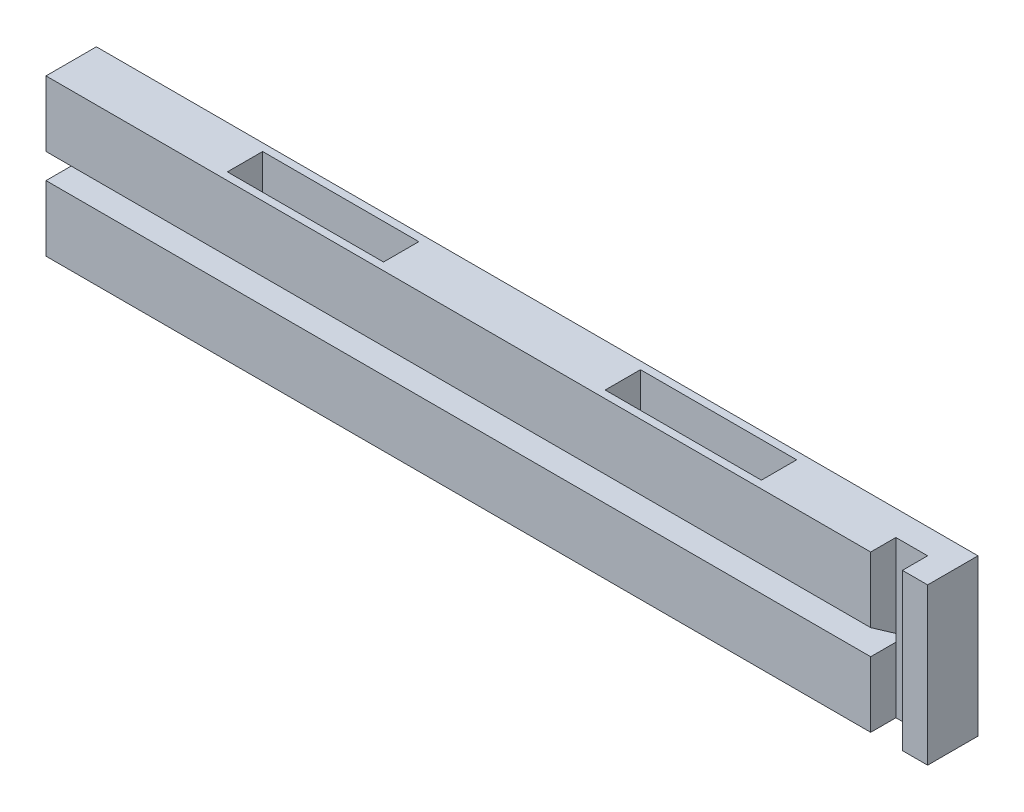
ISO-10303-21;
HEADER;
FILE_DESCRIPTION(('STEP AP214'),'2;1');
FILE_NAME('part.step','',(''),(''),'','','');
FILE_SCHEMA(('AUTOMOTIVE_DESIGN { 1 0 10303 214 1 1 1 1 }'));
ENDSEC;
DATA;
#1=APPLICATION_CONTEXT('core data for automotive mechanical design processes');
#2=APPLICATION_PROTOCOL_DEFINITION('international standard','automotive_design',2000,#1);
#3=PRODUCT_CONTEXT('',#1,'mechanical');
#4=PRODUCT('Part','Part','',(#3));
#5=PRODUCT_RELATED_PRODUCT_CATEGORY('part','',(#4));
#6=PRODUCT_DEFINITION_FORMATION('','',#4);
#7=PRODUCT_DEFINITION_CONTEXT('part definition',#1,'design');
#8=PRODUCT_DEFINITION('design','',#6,#7);
#9=PRODUCT_DEFINITION_SHAPE('','',#8);
#10=(LENGTH_UNIT() NAMED_UNIT(*) SI_UNIT(.MILLI.,.METRE.));
#11=(NAMED_UNIT(*) PLANE_ANGLE_UNIT() SI_UNIT($,.RADIAN.));
#12=(NAMED_UNIT(*) SI_UNIT($,.STERADIAN.) SOLID_ANGLE_UNIT());
#13=UNCERTAINTY_MEASURE_WITH_UNIT(LENGTH_MEASURE(1.E-05),#10,'distance_accuracy_value','');
#14=(GEOMETRIC_REPRESENTATION_CONTEXT(3) GLOBAL_UNCERTAINTY_ASSIGNED_CONTEXT((#13)) GLOBAL_UNIT_ASSIGNED_CONTEXT((#10,
#11,#12)) REPRESENTATION_CONTEXT('',''));
#15=CARTESIAN_POINT('',(0.,0.,0.));
#16=DIRECTION('',(0.,0.,1.));
#17=DIRECTION('',(1.,0.,0.));
#18=AXIS2_PLACEMENT_3D('',#15,#16,#17);
#19=CARTESIAN_POINT('',(0.,0.,10.));
#20=DIRECTION('',(0.,0.,1.));
#21=DIRECTION('',(1.,0.,0.));
#22=AXIS2_PLACEMENT_3D('',#19,#20,#21);
#23=PLANE('',#22);
#24=DIRECTION('',(-1.,0.,0.));
#25=VECTOR('',#24,1.);
#26=CARTESIAN_POINT('',(84.9172339781055,-2.5,10.));
#27=LINE('',#26,#25);
#28=CARTESIAN_POINT('',(76.2,-2.5,10.));
#29=VERTEX_POINT('',#28);
#30=CARTESIAN_POINT('',(-87.5,-2.5,10.));
#31=VERTEX_POINT('',#30);
#32=EDGE_CURVE('E300',#29,#31,#27,.T.);
#33=ORIENTED_EDGE('',*,*,#32,.T.);
#34=DIRECTION('',(0.,-1.,0.));
#35=VECTOR('',#34,1.);
#36=CARTESIAN_POINT('',(-87.5,-15.5,10.));
#37=LINE('',#36,#35);
#38=CARTESIAN_POINT('',(-87.5,-15.5,10.));
#39=VERTEX_POINT('',#38);
#40=EDGE_CURVE('E244',#31,#39,#37,.T.);
#41=ORIENTED_EDGE('',*,*,#40,.T.);
#42=DIRECTION('',(1.,0.,0.));
#43=VECTOR('',#42,1.);
#44=CARTESIAN_POINT('',(87.5,-15.5,10.));
#45=LINE('',#44,#43);
#46=CARTESIAN_POINT('',(76.2,-15.5,10.));
#47=VERTEX_POINT('',#46);
#48=EDGE_CURVE('E246',#39,#47,#45,.T.);
#49=ORIENTED_EDGE('',*,*,#48,.T.);
#50=DIRECTION('',(0.,-1.,0.));
#51=VECTOR('',#50,1.);
#52=CARTESIAN_POINT('',(76.2,-15.5,10.));
#53=LINE('',#52,#51);
#54=EDGE_CURVE('E299',#29,#47,#53,.T.);
#55=ORIENTED_EDGE('',*,*,#54,.F.);
#56=EDGE_LOOP('',(#33,#41,#49,#55));
#57=FACE_BOUND('',#56,.T.);
#58=ADVANCED_FACE('F32',(#57),#23,.T.);
#59=CARTESIAN_POINT('',(76.2,-15.5,5.));
#60=DIRECTION('',(-1.,0.,0.));
#61=DIRECTION('',(0.,0.,1.));
#62=AXIS2_PLACEMENT_3D('',#59,#60,#61);
#63=PLANE('',#62);
#64=DIRECTION('',(0.,-1.,0.));
#65=VECTOR('',#64,1.);
#66=CARTESIAN_POINT('',(76.2,-15.5,5.));
#67=LINE('',#66,#65);
#68=CARTESIAN_POINT('',(76.2,-2.5,5.));
#69=VERTEX_POINT('',#68);
#70=CARTESIAN_POINT('',(76.2,-15.5,5.));
#71=VERTEX_POINT('',#70);
#72=EDGE_CURVE('E314',#69,#71,#67,.T.);
#73=ORIENTED_EDGE('',*,*,#72,.F.);
#74=DIRECTION('',(0.,0.,-1.));
#75=VECTOR('',#74,1.);
#76=CARTESIAN_POINT('',(76.2,-2.5,2.85925996628941));
#77=LINE('',#76,#75);
#78=EDGE_CURVE('E47',#29,#69,#77,.T.);
#79=ORIENTED_EDGE('',*,*,#78,.F.);
#80=ORIENTED_EDGE('',*,*,#54,.T.);
#81=DIRECTION('',(0.,0.,1.));
#82=VECTOR('',#81,1.);
#83=CARTESIAN_POINT('',(76.2,-15.5,5.));
#84=LINE('',#83,#82);
#85=EDGE_CURVE('E295',#71,#47,#84,.T.);
#86=ORIENTED_EDGE('',*,*,#85,.F.);
#87=EDGE_LOOP('',(#73,#79,#80,#86));
#88=FACE_BOUND('',#87,.T.);
#89=ADVANCED_FACE('F500',(#88),#63,.F.);
#90=DIRECTION('',(-1.,0.,0.));
#91=VECTOR('',#90,1.);
#92=CARTESIAN_POINT('',(84.9172339781055,2.5,10.));
#93=LINE('',#92,#91);
#94=CARTESIAN_POINT('',(76.2,2.5,10.));
#95=VERTEX_POINT('',#94);
#96=CARTESIAN_POINT('',(-87.5,2.5,10.));
#97=VERTEX_POINT('',#96);
#98=EDGE_CURVE('E217',#95,#97,#93,.T.);
#99=ORIENTED_EDGE('',*,*,#98,.F.);
#100=CARTESIAN_POINT('',(76.2,15.5,10.));
#101=VERTEX_POINT('',#100);
#102=EDGE_CURVE('E323',#101,#95,#53,.T.);
#103=ORIENTED_EDGE('',*,*,#102,.F.);
#104=DIRECTION('',(-1.,0.,0.));
#105=VECTOR('',#104,1.);
#106=CARTESIAN_POINT('',(87.5,15.5,10.));
#107=LINE('',#106,#105);
#108=CARTESIAN_POINT('',(-87.5,15.5,10.));
#109=VERTEX_POINT('',#108);
#110=EDGE_CURVE('E241',#101,#109,#107,.T.);
#111=ORIENTED_EDGE('',*,*,#110,.T.);
#112=EDGE_CURVE('E237',#109,#97,#37,.T.);
#113=ORIENTED_EDGE('',*,*,#112,.T.);
#114=EDGE_LOOP('',(#99,#103,#111,#113));
#115=FACE_BOUND('',#114,.T.);
#116=ADVANCED_FACE('F239',(#115),#23,.T.);
#117=CARTESIAN_POINT('',(-87.5,-15.5,10.));
#118=DIRECTION('',(1.,0.,0.));
#119=DIRECTION('',(0.,0.,-1.));
#120=AXIS2_PLACEMENT_3D('',#117,#118,#119);
#121=PLANE('',#120);
#122=CARTESIAN_POINT('',(-87.5,10.5,5.));
#123=DIRECTION('',(-1.,0.,0.));
#124=DIRECTION('',(0.,0.,1.));
#125=AXIS2_PLACEMENT_3D('',#122,#123,#124);
#126=CIRCLE('',#125,1.5);
#127=CARTESIAN_POINT('',(-87.5,10.5,6.5));
#128=VERTEX_POINT('',#127);
#129=EDGE_CURVE('E339',#128,#128,#126,.T.);
#130=ORIENTED_EDGE('',*,*,#129,.F.);
#131=EDGE_LOOP('',(#130));
#132=FACE_BOUND('',#131,.T.);
#133=CARTESIAN_POINT('',(-87.5,-10.5,5.));
#134=DIRECTION('',(-1.,0.,0.));
#135=DIRECTION('',(0.,0.,-1.));
#136=AXIS2_PLACEMENT_3D('',#133,#134,#135);
#137=CIRCLE('',#136,1.5);
#138=CARTESIAN_POINT('',(-87.5,-10.5,3.5));
#139=VERTEX_POINT('',#138);
#140=EDGE_CURVE('E329',#139,#139,#137,.T.);
#141=ORIENTED_EDGE('',*,*,#140,.F.);
#142=EDGE_LOOP('',(#141));
#143=FACE_BOUND('',#142,.T.);
#144=ORIENTED_EDGE('',*,*,#40,.F.);
#145=DIRECTION('',(0.,0.,1.));
#146=VECTOR('',#145,1.);
#147=CARTESIAN_POINT('',(-87.5,-2.5,2.85925996628941));
#148=LINE('',#147,#146);
#149=CARTESIAN_POINT('',(-87.5,-2.5,2.85925996628941));
#150=VERTEX_POINT('',#149);
#151=EDGE_CURVE('E231',#150,#31,#148,.T.);
#152=ORIENTED_EDGE('',*,*,#151,.F.);
#153=DIRECTION('',(0.,-0.573576436351045,-0.819152044288992));
#154=VECTOR('',#153,1.);
#155=CARTESIAN_POINT('',(-87.5,2.5,10.));
#156=LINE('',#155,#154);
#157=EDGE_CURVE('E222',#97,#150,#156,.T.);
#158=ORIENTED_EDGE('',*,*,#157,.F.);
#159=ORIENTED_EDGE('',*,*,#112,.F.);
#160=DIRECTION('',(0.,0.,-1.));
#161=VECTOR('',#160,1.);
#162=CARTESIAN_POINT('',(-87.5,15.5,10.));
#163=LINE('',#162,#161);
#164=CARTESIAN_POINT('',(-87.5,15.5,0.));
#165=VERTEX_POINT('',#164);
#166=EDGE_CURVE('E259',#109,#165,#163,.T.);
#167=ORIENTED_EDGE('',*,*,#166,.T.);
#168=DIRECTION('',(0.,-1.,0.));
#169=VECTOR('',#168,1.);
#170=CARTESIAN_POINT('',(-87.5,-15.5,0.));
#171=LINE('',#170,#169);
#172=CARTESIAN_POINT('',(-87.5,-15.5,0.));
#173=VERTEX_POINT('',#172);
#174=EDGE_CURVE('E260',#165,#173,#171,.T.);
#175=ORIENTED_EDGE('',*,*,#174,.T.);
#176=DIRECTION('',(0.,0.,-1.));
#177=VECTOR('',#176,1.);
#178=CARTESIAN_POINT('',(-87.5,-15.5,10.));
#179=LINE('',#178,#177);
#180=EDGE_CURVE('E11',#39,#173,#179,.T.);
#181=ORIENTED_EDGE('',*,*,#180,.F.);
#182=EDGE_LOOP('',(#144,#152,#158,#159,#167,#175,#181));
#183=FACE_BOUND('',#182,.T.);
#184=ADVANCED_FACE('F34',(#132,#143,#183),#121,.F.);
#185=CARTESIAN_POINT('',(87.5,-15.5,10.));
#186=DIRECTION('',(0.,1.,0.));
#187=DIRECTION('',(-1.,0.,0.));
#188=AXIS2_PLACEMENT_3D('',#185,#186,#187);
#189=PLANE('',#188);
#190=DIRECTION('',(1.,0.,0.));
#191=VECTOR('',#190,1.);
#192=CARTESIAN_POINT('',(-22.,-15.5,1.5));
#193=LINE('',#192,#191);
#194=CARTESIAN_POINT('',(-53.,-15.5,1.5));
#195=VERTEX_POINT('',#194);
#196=CARTESIAN_POINT('',(-22.,-15.5,1.5));
#197=VERTEX_POINT('',#196);
#198=EDGE_CURVE('E363',#195,#197,#193,.T.);
#199=ORIENTED_EDGE('',*,*,#198,.F.);
#200=DIRECTION('',(0.,0.,-1.));
#201=VECTOR('',#200,1.);
#202=CARTESIAN_POINT('',(-53.,-15.5,1.5));
#203=LINE('',#202,#201);
#204=CARTESIAN_POINT('',(-53.,-15.5,8.5));
#205=VERTEX_POINT('',#204);
#206=EDGE_CURVE('E361',#205,#195,#203,.T.);
#207=ORIENTED_EDGE('',*,*,#206,.F.);
#208=DIRECTION('',(-1.,0.,0.));
#209=VECTOR('',#208,1.);
#210=CARTESIAN_POINT('',(-22.,-15.5,8.5));
#211=LINE('',#210,#209);
#212=CARTESIAN_POINT('',(-22.,-15.5,8.5));
#213=VERTEX_POINT('',#212);
#214=EDGE_CURVE('E351',#213,#205,#211,.T.);
#215=ORIENTED_EDGE('',*,*,#214,.F.);
#216=DIRECTION('',(0.,0.,1.));
#217=VECTOR('',#216,1.);
#218=CARTESIAN_POINT('',(-22.,-15.5,1.5));
#219=LINE('',#218,#217);
#220=EDGE_CURVE('E367',#197,#213,#219,.T.);
#221=ORIENTED_EDGE('',*,*,#220,.F.);
#222=EDGE_LOOP('',(#199,#207,#215,#221));
#223=FACE_BOUND('',#222,.T.);
#224=DIRECTION('',(1.,0.,0.));
#225=VECTOR('',#224,1.);
#226=CARTESIAN_POINT('',(22.,-15.5,1.50000000000001));
#227=LINE('',#226,#225);
#228=CARTESIAN_POINT('',(22.,-15.5,1.50000000000001));
#229=VERTEX_POINT('',#228);
#230=CARTESIAN_POINT('',(53.,-15.5,1.50000000000001));
#231=VERTEX_POINT('',#230);
#232=EDGE_CURVE('E396',#229,#231,#227,.T.);
#233=ORIENTED_EDGE('',*,*,#232,.F.);
#234=DIRECTION('',(0.,0.,-1.));
#235=VECTOR('',#234,1.);
#236=CARTESIAN_POINT('',(22.,-15.5,1.50000000000001));
#237=LINE('',#236,#235);
#238=CARTESIAN_POINT('',(22.,-15.5,8.50000000000001));
#239=VERTEX_POINT('',#238);
#240=EDGE_CURVE('E338',#239,#229,#237,.T.);
#241=ORIENTED_EDGE('',*,*,#240,.F.);
#242=DIRECTION('',(-1.,0.,0.));
#243=VECTOR('',#242,1.);
#244=CARTESIAN_POINT('',(22.,-15.5,8.50000000000001));
#245=LINE('',#244,#243);
#246=CARTESIAN_POINT('',(53.,-15.5,8.50000000000001));
#247=VERTEX_POINT('',#246);
#248=EDGE_CURVE('E385',#247,#239,#245,.T.);
#249=ORIENTED_EDGE('',*,*,#248,.F.);
#250=DIRECTION('',(0.,0.,1.));
#251=VECTOR('',#250,1.);
#252=CARTESIAN_POINT('',(53.,-15.5,1.50000000000001));
#253=LINE('',#252,#251);
#254=EDGE_CURVE('E399',#231,#247,#253,.T.);
#255=ORIENTED_EDGE('',*,*,#254,.F.);
#256=EDGE_LOOP('',(#233,#241,#249,#255));
#257=FACE_BOUND('',#256,.T.);
#258=DIRECTION('',(1.,0.,0.));
#259=VECTOR('',#258,1.);
#260=CARTESIAN_POINT('',(82.5,-15.5,5.));
#261=LINE('',#260,#259);
#262=CARTESIAN_POINT('',(82.5,-15.5,5.));
#263=VERTEX_POINT('',#262);
#264=EDGE_CURVE('E312',#71,#263,#261,.T.);
#265=ORIENTED_EDGE('',*,*,#264,.F.);
#266=ORIENTED_EDGE('',*,*,#85,.T.);
#267=ORIENTED_EDGE('',*,*,#48,.F.);
#268=ORIENTED_EDGE('',*,*,#180,.T.);
#269=DIRECTION('',(1.,0.,0.));
#270=VECTOR('',#269,1.);
#271=CARTESIAN_POINT('',(87.5,-15.5,0.));
#272=LINE('',#271,#270);
#273=CARTESIAN_POINT('',(87.5,-15.5,0.));
#274=VERTEX_POINT('',#273);
#275=EDGE_CURVE('E263',#173,#274,#272,.T.);
#276=ORIENTED_EDGE('',*,*,#275,.T.);
#277=DIRECTION('',(0.,0.,-1.));
#278=VECTOR('',#277,1.);
#279=CARTESIAN_POINT('',(87.5,-15.5,10.));
#280=LINE('',#279,#278);
#281=CARTESIAN_POINT('',(87.5,-15.5,10.));
#282=VERTEX_POINT('',#281);
#283=EDGE_CURVE('E40',#282,#274,#280,.T.);
#284=ORIENTED_EDGE('',*,*,#283,.F.);
#285=CARTESIAN_POINT('',(82.5,-15.5,10.));
#286=VERTEX_POINT('',#285);
#287=EDGE_CURVE('E243',#286,#282,#45,.T.);
#288=ORIENTED_EDGE('',*,*,#287,.F.);
#289=DIRECTION('',(0.,0.,1.));
#290=VECTOR('',#289,1.);
#291=CARTESIAN_POINT('',(82.5,-15.5,5.));
#292=LINE('',#291,#290);
#293=EDGE_CURVE('E55',#263,#286,#292,.T.);
#294=ORIENTED_EDGE('',*,*,#293,.F.);
#295=EDGE_LOOP('',(#265,#266,#267,#268,#276,#284,#288,#294));
#296=FACE_BOUND('',#295,.T.);
#297=ADVANCED_FACE('F292',(#223,#257,#296),#189,.F.);
#298=CARTESIAN_POINT('',(87.5,-15.5,10.));
#299=DIRECTION('',(-1.,0.,0.));
#300=DIRECTION('',(0.,0.,1.));
#301=AXIS2_PLACEMENT_3D('',#298,#299,#300);
#302=PLANE('',#301);
#303=DIRECTION('',(0.,1.,0.));
#304=VECTOR('',#303,1.);
#305=CARTESIAN_POINT('',(87.5,-15.5,0.));
#306=LINE('',#305,#304);
#307=CARTESIAN_POINT('',(87.5,15.5,0.));
#308=VERTEX_POINT('',#307);
#309=EDGE_CURVE('E266',#274,#308,#306,.T.);
#310=ORIENTED_EDGE('',*,*,#309,.T.);
#311=DIRECTION('',(0.,0.,-1.));
#312=VECTOR('',#311,1.);
#313=CARTESIAN_POINT('',(87.5,15.5,10.));
#314=LINE('',#313,#312);
#315=CARTESIAN_POINT('',(87.5,15.5,10.));
#316=VERTEX_POINT('',#315);
#317=EDGE_CURVE('E270',#316,#308,#314,.T.);
#318=ORIENTED_EDGE('',*,*,#317,.F.);
#319=DIRECTION('',(0.,1.,0.));
#320=VECTOR('',#319,1.);
#321=CARTESIAN_POINT('',(87.5,-15.5,10.));
#322=LINE('',#321,#320);
#323=EDGE_CURVE('E254',#282,#316,#322,.T.);
#324=ORIENTED_EDGE('',*,*,#323,.F.);
#325=ORIENTED_EDGE('',*,*,#283,.T.);
#326=EDGE_LOOP('',(#310,#318,#324,#325));
#327=FACE_BOUND('',#326,.T.);
#328=ADVANCED_FACE('F277',(#327),#302,.F.);
#329=CARTESIAN_POINT('',(87.5,15.5,10.));
#330=DIRECTION('',(0.,-1.,0.));
#331=DIRECTION('',(1.,0.,0.));
#332=AXIS2_PLACEMENT_3D('',#329,#330,#331);
#333=PLANE('',#332);
#334=ORIENTED_EDGE('',*,*,#110,.F.);
#335=DIRECTION('',(0.,0.,1.));
#336=VECTOR('',#335,1.);
#337=CARTESIAN_POINT('',(76.2,15.5,5.));
#338=LINE('',#337,#336);
#339=CARTESIAN_POINT('',(76.2,15.5,5.));
#340=VERTEX_POINT('',#339);
#341=EDGE_CURVE('E327',#340,#101,#338,.T.);
#342=ORIENTED_EDGE('',*,*,#341,.F.);
#343=DIRECTION('',(-1.,0.,0.));
#344=VECTOR('',#343,1.);
#345=CARTESIAN_POINT('',(82.5,15.5,5.));
#346=LINE('',#345,#344);
#347=CARTESIAN_POINT('',(82.5,15.5,5.));
#348=VERTEX_POINT('',#347);
#349=EDGE_CURVE('E320',#348,#340,#346,.T.);
#350=ORIENTED_EDGE('',*,*,#349,.F.);
#351=DIRECTION('',(0.,0.,1.));
#352=VECTOR('',#351,1.);
#353=CARTESIAN_POINT('',(82.5,15.5,5.));
#354=LINE('',#353,#352);
#355=CARTESIAN_POINT('',(82.5,15.5,10.));
#356=VERTEX_POINT('',#355);
#357=EDGE_CURVE('E330',#348,#356,#354,.T.);
#358=ORIENTED_EDGE('',*,*,#357,.T.);
#359=EDGE_CURVE('E256',#316,#356,#107,.T.);
#360=ORIENTED_EDGE('',*,*,#359,.F.);
#361=ORIENTED_EDGE('',*,*,#317,.T.);
#362=DIRECTION('',(-1.,0.,0.));
#363=VECTOR('',#362,1.);
#364=CARTESIAN_POINT('',(87.5,15.5,0.));
#365=LINE('',#364,#363);
#366=EDGE_CURVE('E248',#308,#165,#365,.T.);
#367=ORIENTED_EDGE('',*,*,#366,.T.);
#368=ORIENTED_EDGE('',*,*,#166,.F.);
#369=EDGE_LOOP('',(#334,#342,#350,#358,#360,#361,#367,#368));
#370=FACE_BOUND('',#369,.T.);
#371=DIRECTION('',(1.,0.,0.));
#372=VECTOR('',#371,1.);
#373=CARTESIAN_POINT('',(-22.,15.5,8.49999999999998));
#374=LINE('',#373,#372);
#375=CARTESIAN_POINT('',(-53.,15.5,8.49999999999999));
#376=VERTEX_POINT('',#375);
#377=CARTESIAN_POINT('',(-22.,15.5,8.49999999999998));
#378=VERTEX_POINT('',#377);
#379=EDGE_CURVE('E427',#376,#378,#374,.T.);
#380=ORIENTED_EDGE('',*,*,#379,.F.);
#381=DIRECTION('',(0.,0.,1.));
#382=VECTOR('',#381,1.);
#383=CARTESIAN_POINT('',(-53.,15.5,8.49999999999999));
#384=LINE('',#383,#382);
#385=CARTESIAN_POINT('',(-53.,15.5,1.49999999999999));
#386=VERTEX_POINT('',#385);
#387=EDGE_CURVE('E425',#386,#376,#384,.T.);
#388=ORIENTED_EDGE('',*,*,#387,.F.);
#389=DIRECTION('',(-1.,0.,0.));
#390=VECTOR('',#389,1.);
#391=CARTESIAN_POINT('',(-22.,15.5,1.49999999999998));
#392=LINE('',#391,#390);
#393=CARTESIAN_POINT('',(-22.,15.5,1.49999999999998));
#394=VERTEX_POINT('',#393);
#395=EDGE_CURVE('E415',#394,#386,#392,.T.);
#396=ORIENTED_EDGE('',*,*,#395,.F.);
#397=DIRECTION('',(0.,0.,-1.));
#398=VECTOR('',#397,1.);
#399=CARTESIAN_POINT('',(-22.,15.5,8.49999999999998));
#400=LINE('',#399,#398);
#401=EDGE_CURVE('E431',#378,#394,#400,.T.);
#402=ORIENTED_EDGE('',*,*,#401,.F.);
#403=EDGE_LOOP('',(#380,#388,#396,#402));
#404=FACE_BOUND('',#403,.T.);
#405=DIRECTION('',(1.,0.,0.));
#406=VECTOR('',#405,1.);
#407=CARTESIAN_POINT('',(22.,15.5,8.49999999999998));
#408=LINE('',#407,#406);
#409=CARTESIAN_POINT('',(22.,15.5,8.49999999999998));
#410=VERTEX_POINT('',#409);
#411=CARTESIAN_POINT('',(53.,15.5,8.49999999999998));
#412=VERTEX_POINT('',#411);
#413=EDGE_CURVE('E457',#410,#412,#408,.T.);
#414=ORIENTED_EDGE('',*,*,#413,.F.);
#415=DIRECTION('',(0.,0.,1.));
#416=VECTOR('',#415,1.);
#417=CARTESIAN_POINT('',(22.,15.5,8.49999999999998));
#418=LINE('',#417,#416);
#419=CARTESIAN_POINT('',(22.,15.5,1.49999999999998));
#420=VERTEX_POINT('',#419);
#421=EDGE_CURVE('E374',#420,#410,#418,.T.);
#422=ORIENTED_EDGE('',*,*,#421,.F.);
#423=DIRECTION('',(-1.,0.,0.));
#424=VECTOR('',#423,1.);
#425=CARTESIAN_POINT('',(22.,15.5,1.49999999999998));
#426=LINE('',#425,#424);
#427=CARTESIAN_POINT('',(53.,15.5,1.49999999999998));
#428=VERTEX_POINT('',#427);
#429=EDGE_CURVE('E447',#428,#420,#426,.T.);
#430=ORIENTED_EDGE('',*,*,#429,.F.);
#431=DIRECTION('',(0.,0.,-1.));
#432=VECTOR('',#431,1.);
#433=CARTESIAN_POINT('',(53.,15.5,8.49999999999998));
#434=LINE('',#433,#432);
#435=EDGE_CURVE('E460',#412,#428,#434,.T.);
#436=ORIENTED_EDGE('',*,*,#435,.F.);
#437=EDGE_LOOP('',(#414,#422,#430,#436));
#438=FACE_BOUND('',#437,.T.);
#439=ADVANCED_FACE('F286',(#370,#404,#438),#333,.F.);
#440=DIRECTION('',(0.,1.,0.));
#441=VECTOR('',#440,1.);
#442=CARTESIAN_POINT('',(82.5,-15.5,10.));
#443=LINE('',#442,#441);
#444=EDGE_CURVE('E325',#286,#356,#443,.T.);
#445=ORIENTED_EDGE('',*,*,#444,.F.);
#446=ORIENTED_EDGE('',*,*,#287,.T.);
#447=ORIENTED_EDGE('',*,*,#323,.T.);
#448=ORIENTED_EDGE('',*,*,#359,.T.);
#449=EDGE_LOOP('',(#445,#446,#447,#448));
#450=FACE_BOUND('',#449,.T.);
#451=ADVANCED_FACE('F495',(#450),#23,.T.);
#452=CARTESIAN_POINT('',(0.,0.,0.));
#453=DIRECTION('',(0.,0.,1.));
#454=DIRECTION('',(1.,0.,0.));
#455=AXIS2_PLACEMENT_3D('',#452,#453,#454);
#456=PLANE('',#455);
#457=ORIENTED_EDGE('',*,*,#174,.F.);
#458=ORIENTED_EDGE('',*,*,#366,.F.);
#459=ORIENTED_EDGE('',*,*,#309,.F.);
#460=ORIENTED_EDGE('',*,*,#275,.F.);
#461=EDGE_LOOP('',(#457,#458,#459,#460));
#462=FACE_BOUND('',#461,.T.);
#463=ADVANCED_FACE('F284',(#462),#456,.F.);
#464=CARTESIAN_POINT('',(22.,5.,8.49999999999998));
#465=DIRECTION('',(-1.,0.,0.));
#466=DIRECTION('',(0.,-1.,0.));
#467=AXIS2_PLACEMENT_3D('',#464,#465,#466);
#468=PLANE('',#467);
#469=ORIENTED_EDGE('',*,*,#421,.T.);
#470=DIRECTION('',(0.,1.,0.));
#471=VECTOR('',#470,1.);
#472=CARTESIAN_POINT('',(22.,5.,8.49999999999998));
#473=LINE('',#472,#471);
#474=CARTESIAN_POINT('',(22.,5.,8.49999999999998));
#475=VERTEX_POINT('',#474);
#476=EDGE_CURVE('E250',#475,#410,#473,.T.);
#477=ORIENTED_EDGE('',*,*,#476,.F.);
#478=DIRECTION('',(0.,0.,1.));
#479=VECTOR('',#478,1.);
#480=CARTESIAN_POINT('',(22.,5.,8.49999999999998));
#481=LINE('',#480,#479);
#482=CARTESIAN_POINT('',(22.,5.,1.49999999999998));
#483=VERTEX_POINT('',#482);
#484=EDGE_CURVE('E443',#483,#475,#481,.T.);
#485=ORIENTED_EDGE('',*,*,#484,.F.);
#486=DIRECTION('',(0.,1.,0.));
#487=VECTOR('',#486,1.);
#488=CARTESIAN_POINT('',(22.,5.,1.49999999999998));
#489=LINE('',#488,#487);
#490=EDGE_CURVE('E428',#483,#420,#489,.T.);
#491=ORIENTED_EDGE('',*,*,#490,.T.);
#492=EDGE_LOOP('',(#469,#477,#485,#491));
#493=FACE_BOUND('',#492,.T.);
#494=ADVANCED_FACE('F487',(#493),#468,.F.);
#495=CARTESIAN_POINT('',(22.,5.,1.49999999999998));
#496=DIRECTION('',(0.,0.,-1.));
#497=DIRECTION('',(-1.,0.,0.));
#498=AXIS2_PLACEMENT_3D('',#495,#496,#497);
#499=PLANE('',#498);
#500=ORIENTED_EDGE('',*,*,#429,.T.);
#501=ORIENTED_EDGE('',*,*,#490,.F.);
#502=DIRECTION('',(-1.,0.,0.));
#503=VECTOR('',#502,1.);
#504=CARTESIAN_POINT('',(22.,5.,1.49999999999998));
#505=LINE('',#504,#503);
#506=CARTESIAN_POINT('',(53.,5.,1.49999999999998));
#507=VERTEX_POINT('',#506);
#508=EDGE_CURVE('E453',#507,#483,#505,.T.);
#509=ORIENTED_EDGE('',*,*,#508,.F.);
#510=DIRECTION('',(0.,1.,0.));
#511=VECTOR('',#510,1.);
#512=CARTESIAN_POINT('',(53.,5.,1.49999999999998));
#513=LINE('',#512,#511);
#514=EDGE_CURVE('E466',#507,#428,#513,.T.);
#515=ORIENTED_EDGE('',*,*,#514,.T.);
#516=EDGE_LOOP('',(#500,#501,#509,#515));
#517=FACE_BOUND('',#516,.T.);
#518=ADVANCED_FACE('F486',(#517),#499,.F.);
#519=CARTESIAN_POINT('',(53.,5.,8.49999999999998));
#520=DIRECTION('',(1.,0.,0.));
#521=DIRECTION('',(0.,1.,0.));
#522=AXIS2_PLACEMENT_3D('',#519,#520,#521);
#523=PLANE('',#522);
#524=ORIENTED_EDGE('',*,*,#435,.T.);
#525=ORIENTED_EDGE('',*,*,#514,.F.);
#526=DIRECTION('',(0.,0.,-1.));
#527=VECTOR('',#526,1.);
#528=CARTESIAN_POINT('',(53.,5.,8.49999999999998));
#529=LINE('',#528,#527);
#530=CARTESIAN_POINT('',(53.,5.,8.49999999999998));
#531=VERTEX_POINT('',#530);
#532=EDGE_CURVE('E450',#531,#507,#529,.T.);
#533=ORIENTED_EDGE('',*,*,#532,.F.);
#534=DIRECTION('',(0.,1.,0.));
#535=VECTOR('',#534,1.);
#536=CARTESIAN_POINT('',(53.,5.,8.49999999999998));
#537=LINE('',#536,#535);
#538=EDGE_CURVE('E467',#531,#412,#537,.T.);
#539=ORIENTED_EDGE('',*,*,#538,.T.);
#540=EDGE_LOOP('',(#524,#525,#533,#539));
#541=FACE_BOUND('',#540,.T.);
#542=ADVANCED_FACE('F481',(#541),#523,.F.);
#543=CARTESIAN_POINT('',(22.,5.,8.49999999999998));
#544=DIRECTION('',(0.,0.,1.));
#545=DIRECTION('',(1.,0.,0.));
#546=AXIS2_PLACEMENT_3D('',#543,#544,#545);
#547=PLANE('',#546);
#548=ORIENTED_EDGE('',*,*,#413,.T.);
#549=ORIENTED_EDGE('',*,*,#538,.F.);
#550=DIRECTION('',(1.,0.,0.));
#551=VECTOR('',#550,1.);
#552=CARTESIAN_POINT('',(22.,5.,8.49999999999998));
#553=LINE('',#552,#551);
#554=EDGE_CURVE('E446',#475,#531,#553,.T.);
#555=ORIENTED_EDGE('',*,*,#554,.F.);
#556=ORIENTED_EDGE('',*,*,#476,.T.);
#557=EDGE_LOOP('',(#548,#549,#555,#556));
#558=FACE_BOUND('',#557,.T.);
#559=ADVANCED_FACE('F474',(#558),#547,.F.);
#560=CARTESIAN_POINT('',(0.,4.99999999999999,0.));
#561=DIRECTION('',(0.,-1.,0.));
#562=DIRECTION('',(1.,0.,0.));
#563=AXIS2_PLACEMENT_3D('',#560,#561,#562);
#564=PLANE('',#563);
#565=ORIENTED_EDGE('',*,*,#484,.T.);
#566=ORIENTED_EDGE('',*,*,#554,.T.);
#567=ORIENTED_EDGE('',*,*,#532,.T.);
#568=ORIENTED_EDGE('',*,*,#508,.T.);
#569=EDGE_LOOP('',(#565,#566,#567,#568));
#570=FACE_BOUND('',#569,.T.);
#571=ADVANCED_FACE('F485',(#570),#564,.F.);
#572=CARTESIAN_POINT('',(-53.,4.99999999999999,8.49999999999999));
#573=DIRECTION('',(-1.,0.,0.));
#574=DIRECTION('',(0.,-1.,0.));
#575=AXIS2_PLACEMENT_3D('',#572,#573,#574);
#576=PLANE('',#575);
#577=ORIENTED_EDGE('',*,*,#387,.T.);
#578=DIRECTION('',(0.,1.,0.));
#579=VECTOR('',#578,1.);
#580=CARTESIAN_POINT('',(-53.,4.99999999999999,8.49999999999999));
#581=LINE('',#580,#579);
#582=CARTESIAN_POINT('',(-53.,4.99999999999999,8.49999999999999));
#583=VERTEX_POINT('',#582);
#584=EDGE_CURVE('E424',#583,#376,#581,.T.);
#585=ORIENTED_EDGE('',*,*,#584,.F.);
#586=DIRECTION('',(0.,0.,1.));
#587=VECTOR('',#586,1.);
#588=CARTESIAN_POINT('',(-53.,4.99999999999999,8.49999999999999));
#589=LINE('',#588,#587);
#590=CARTESIAN_POINT('',(-53.,4.99999999999999,1.49999999999999));
#591=VERTEX_POINT('',#590);
#592=EDGE_CURVE('E411',#591,#583,#589,.T.);
#593=ORIENTED_EDGE('',*,*,#592,.F.);
#594=DIRECTION('',(0.,1.,0.));
#595=VECTOR('',#594,1.);
#596=CARTESIAN_POINT('',(-53.,4.99999999999999,1.49999999999999));
#597=LINE('',#596,#595);
#598=EDGE_CURVE('E264',#591,#386,#597,.T.);
#599=ORIENTED_EDGE('',*,*,#598,.T.);
#600=EDGE_LOOP('',(#577,#585,#593,#599));
#601=FACE_BOUND('',#600,.T.);
#602=ADVANCED_FACE('F600',(#601),#576,.F.);
#603=CARTESIAN_POINT('',(-22.,4.99999999999999,1.49999999999998));
#604=DIRECTION('',(0.,0.,-1.));
#605=DIRECTION('',(-1.,0.,0.));
#606=AXIS2_PLACEMENT_3D('',#603,#604,#605);
#607=PLANE('',#606);
#608=ORIENTED_EDGE('',*,*,#395,.T.);
#609=ORIENTED_EDGE('',*,*,#598,.F.);
#610=DIRECTION('',(-1.,0.,0.));
#611=VECTOR('',#610,1.);
#612=CARTESIAN_POINT('',(-22.,4.99999999999999,1.49999999999998));
#613=LINE('',#612,#611);
#614=CARTESIAN_POINT('',(-22.,4.99999999999999,1.49999999999998));
#615=VERTEX_POINT('',#614);
#616=EDGE_CURVE('E421',#615,#591,#613,.T.);
#617=ORIENTED_EDGE('',*,*,#616,.F.);
#618=DIRECTION('',(0.,1.,0.));
#619=VECTOR('',#618,1.);
#620=CARTESIAN_POINT('',(-22.,4.99999999999999,1.49999999999998));
#621=LINE('',#620,#619);
#622=EDGE_CURVE('E437',#615,#394,#621,.T.);
#623=ORIENTED_EDGE('',*,*,#622,.T.);
#624=EDGE_LOOP('',(#608,#609,#617,#623));
#625=FACE_BOUND('',#624,.T.);
#626=ADVANCED_FACE('F596',(#625),#607,.F.);
#627=CARTESIAN_POINT('',(-22.,4.99999999999999,8.49999999999998));
#628=DIRECTION('',(1.,0.,0.));
#629=DIRECTION('',(0.,1.,0.));
#630=AXIS2_PLACEMENT_3D('',#627,#628,#629);
#631=PLANE('',#630);
#632=ORIENTED_EDGE('',*,*,#401,.T.);
#633=ORIENTED_EDGE('',*,*,#622,.F.);
#634=DIRECTION('',(0.,0.,-1.));
#635=VECTOR('',#634,1.);
#636=CARTESIAN_POINT('',(-22.,4.99999999999999,8.49999999999998));
#637=LINE('',#636,#635);
#638=CARTESIAN_POINT('',(-22.,4.99999999999999,8.49999999999998));
#639=VERTEX_POINT('',#638);
#640=EDGE_CURVE('E418',#639,#615,#637,.T.);
#641=ORIENTED_EDGE('',*,*,#640,.F.);
#642=DIRECTION('',(0.,1.,0.));
#643=VECTOR('',#642,1.);
#644=CARTESIAN_POINT('',(-22.,4.99999999999999,8.49999999999998));
#645=LINE('',#644,#643);
#646=EDGE_CURVE('E439',#639,#378,#645,.T.);
#647=ORIENTED_EDGE('',*,*,#646,.T.);
#648=EDGE_LOOP('',(#632,#633,#641,#647));
#649=FACE_BOUND('',#648,.T.);
#650=ADVANCED_FACE('F599',(#649),#631,.F.);
#651=CARTESIAN_POINT('',(-22.,4.99999999999999,8.49999999999998));
#652=DIRECTION('',(0.,0.,1.));
#653=DIRECTION('',(1.,0.,0.));
#654=AXIS2_PLACEMENT_3D('',#651,#652,#653);
#655=PLANE('',#654);
#656=ORIENTED_EDGE('',*,*,#379,.T.);
#657=ORIENTED_EDGE('',*,*,#646,.F.);
#658=DIRECTION('',(1.,0.,0.));
#659=VECTOR('',#658,1.);
#660=CARTESIAN_POINT('',(-22.,4.99999999999999,8.49999999999998));
#661=LINE('',#660,#659);
#662=EDGE_CURVE('E414',#583,#639,#661,.T.);
#663=ORIENTED_EDGE('',*,*,#662,.F.);
#664=ORIENTED_EDGE('',*,*,#584,.T.);
#665=EDGE_LOOP('',(#656,#657,#663,#664));
#666=FACE_BOUND('',#665,.T.);
#667=ADVANCED_FACE('F594',(#666),#655,.F.);
#668=CARTESIAN_POINT('',(0.,4.99999999999999,0.));
#669=DIRECTION('',(0.,1.,0.));
#670=DIRECTION('',(-1.,0.,0.));
#671=AXIS2_PLACEMENT_3D('',#668,#669,#670);
#672=PLANE('',#671);
#673=ORIENTED_EDGE('',*,*,#592,.T.);
#674=ORIENTED_EDGE('',*,*,#662,.T.);
#675=ORIENTED_EDGE('',*,*,#640,.T.);
#676=ORIENTED_EDGE('',*,*,#616,.T.);
#677=EDGE_LOOP('',(#673,#674,#675,#676));
#678=FACE_BOUND('',#677,.T.);
#679=ADVANCED_FACE('F590',(#678),#672,.T.);
#680=CARTESIAN_POINT('',(22.,-5.,1.50000000000001));
#681=DIRECTION('',(-1.,0.,0.));
#682=DIRECTION('',(0.,0.,1.));
#683=AXIS2_PLACEMENT_3D('',#680,#681,#682);
#684=PLANE('',#683);
#685=ORIENTED_EDGE('',*,*,#240,.T.);
#686=DIRECTION('',(0.,-1.,0.));
#687=VECTOR('',#686,1.);
#688=CARTESIAN_POINT('',(22.,-5.,1.50000000000001));
#689=LINE('',#688,#687);
#690=CARTESIAN_POINT('',(22.,-5.,1.50000000000001));
#691=VERTEX_POINT('',#690);
#692=EDGE_CURVE('E394',#691,#229,#689,.T.);
#693=ORIENTED_EDGE('',*,*,#692,.F.);
#694=DIRECTION('',(0.,0.,-1.));
#695=VECTOR('',#694,1.);
#696=CARTESIAN_POINT('',(22.,-5.,1.50000000000001));
#697=LINE('',#696,#695);
#698=CARTESIAN_POINT('',(22.,-5.,8.50000000000001));
#699=VERTEX_POINT('',#698);
#700=EDGE_CURVE('E381',#699,#691,#697,.T.);
#701=ORIENTED_EDGE('',*,*,#700,.F.);
#702=DIRECTION('',(0.,-1.,0.));
#703=VECTOR('',#702,1.);
#704=CARTESIAN_POINT('',(22.,-5.,8.50000000000001));
#705=LINE('',#704,#703);
#706=EDGE_CURVE('E364',#699,#239,#705,.T.);
#707=ORIENTED_EDGE('',*,*,#706,.T.);
#708=EDGE_LOOP('',(#685,#693,#701,#707));
#709=FACE_BOUND('',#708,.T.);
#710=ADVANCED_FACE('F580',(#709),#684,.F.);
#711=CARTESIAN_POINT('',(22.,-5.,8.50000000000001));
#712=DIRECTION('',(0.,0.,1.));
#713=DIRECTION('',(1.,0.,0.));
#714=AXIS2_PLACEMENT_3D('',#711,#712,#713);
#715=PLANE('',#714);
#716=ORIENTED_EDGE('',*,*,#248,.T.);
#717=ORIENTED_EDGE('',*,*,#706,.F.);
#718=DIRECTION('',(-1.,0.,0.));
#719=VECTOR('',#718,1.);
#720=CARTESIAN_POINT('',(22.,-5.,8.50000000000001));
#721=LINE('',#720,#719);
#722=CARTESIAN_POINT('',(53.,-5.,8.50000000000001));
#723=VERTEX_POINT('',#722);
#724=EDGE_CURVE('E391',#723,#699,#721,.T.);
#725=ORIENTED_EDGE('',*,*,#724,.F.);
#726=DIRECTION('',(0.,-1.,0.));
#727=VECTOR('',#726,1.);
#728=CARTESIAN_POINT('',(53.,-5.,8.50000000000001));
#729=LINE('',#728,#727);
#730=EDGE_CURVE('E405',#723,#247,#729,.T.);
#731=ORIENTED_EDGE('',*,*,#730,.T.);
#732=EDGE_LOOP('',(#716,#717,#725,#731));
#733=FACE_BOUND('',#732,.T.);
#734=ADVANCED_FACE('F576',(#733),#715,.F.);
#735=CARTESIAN_POINT('',(53.,-5.,1.50000000000001));
#736=DIRECTION('',(1.,0.,0.));
#737=DIRECTION('',(0.,1.,0.));
#738=AXIS2_PLACEMENT_3D('',#735,#736,#737);
#739=PLANE('',#738);
#740=ORIENTED_EDGE('',*,*,#254,.T.);
#741=ORIENTED_EDGE('',*,*,#730,.F.);
#742=DIRECTION('',(0.,0.,1.));
#743=VECTOR('',#742,1.);
#744=CARTESIAN_POINT('',(53.,-5.,1.50000000000001));
#745=LINE('',#744,#743);
#746=CARTESIAN_POINT('',(53.,-5.,1.50000000000001));
#747=VERTEX_POINT('',#746);
#748=EDGE_CURVE('E388',#747,#723,#745,.T.);
#749=ORIENTED_EDGE('',*,*,#748,.F.);
#750=DIRECTION('',(0.,-1.,0.));
#751=VECTOR('',#750,1.);
#752=CARTESIAN_POINT('',(53.,-5.,1.50000000000001));
#753=LINE('',#752,#751);
#754=EDGE_CURVE('E407',#747,#231,#753,.T.);
#755=ORIENTED_EDGE('',*,*,#754,.T.);
#756=EDGE_LOOP('',(#740,#741,#749,#755));
#757=FACE_BOUND('',#756,.T.);
#758=ADVANCED_FACE('F579',(#757),#739,.F.);
#759=CARTESIAN_POINT('',(22.,-5.,1.50000000000001));
#760=DIRECTION('',(0.,0.,-1.));
#761=DIRECTION('',(-1.,0.,0.));
#762=AXIS2_PLACEMENT_3D('',#759,#760,#761);
#763=PLANE('',#762);
#764=ORIENTED_EDGE('',*,*,#232,.T.);
#765=ORIENTED_EDGE('',*,*,#754,.F.);
#766=DIRECTION('',(1.,0.,0.));
#767=VECTOR('',#766,1.);
#768=CARTESIAN_POINT('',(22.,-5.,1.50000000000001));
#769=LINE('',#768,#767);
#770=EDGE_CURVE('E384',#691,#747,#769,.T.);
#771=ORIENTED_EDGE('',*,*,#770,.F.);
#772=ORIENTED_EDGE('',*,*,#692,.T.);
#773=EDGE_LOOP('',(#764,#765,#771,#772));
#774=FACE_BOUND('',#773,.T.);
#775=ADVANCED_FACE('F574',(#774),#763,.F.);
#776=CARTESIAN_POINT('',(0.,-5.,0.));
#777=DIRECTION('',(0.,1.,0.));
#778=DIRECTION('',(-1.,0.,0.));
#779=AXIS2_PLACEMENT_3D('',#776,#777,#778);
#780=PLANE('',#779);
#781=ORIENTED_EDGE('',*,*,#700,.T.);
#782=ORIENTED_EDGE('',*,*,#770,.T.);
#783=ORIENTED_EDGE('',*,*,#748,.T.);
#784=ORIENTED_EDGE('',*,*,#724,.T.);
#785=EDGE_LOOP('',(#781,#782,#783,#784));
#786=FACE_BOUND('',#785,.T.);
#787=ADVANCED_FACE('F570',(#786),#780,.F.);
#788=CARTESIAN_POINT('',(-53.,-5.00000000000001,1.5));
#789=DIRECTION('',(-1.,0.,0.));
#790=DIRECTION('',(0.,-1.,0.));
#791=AXIS2_PLACEMENT_3D('',#788,#789,#790);
#792=PLANE('',#791);
#793=ORIENTED_EDGE('',*,*,#206,.T.);
#794=DIRECTION('',(0.,-1.,0.));
#795=VECTOR('',#794,1.);
#796=CARTESIAN_POINT('',(-53.,-5.00000000000001,1.5));
#797=LINE('',#796,#795);
#798=CARTESIAN_POINT('',(-53.,-5.00000000000001,1.5));
#799=VERTEX_POINT('',#798);
#800=EDGE_CURVE('E360',#799,#195,#797,.T.);
#801=ORIENTED_EDGE('',*,*,#800,.F.);
#802=DIRECTION('',(0.,0.,-1.));
#803=VECTOR('',#802,1.);
#804=CARTESIAN_POINT('',(-53.,-5.00000000000001,1.5));
#805=LINE('',#804,#803);
#806=CARTESIAN_POINT('',(-53.,-5.00000000000001,8.5));
#807=VERTEX_POINT('',#806);
#808=EDGE_CURVE('E347',#807,#799,#805,.T.);
#809=ORIENTED_EDGE('',*,*,#808,.F.);
#810=DIRECTION('',(0.,-1.,0.));
#811=VECTOR('',#810,1.);
#812=CARTESIAN_POINT('',(-53.,-5.00000000000001,8.5));
#813=LINE('',#812,#811);
#814=EDGE_CURVE('E372',#807,#205,#813,.T.);
#815=ORIENTED_EDGE('',*,*,#814,.T.);
#816=EDGE_LOOP('',(#793,#801,#809,#815));
#817=FACE_BOUND('',#816,.T.);
#818=ADVANCED_FACE('F560',(#817),#792,.F.);
#819=CARTESIAN_POINT('',(-22.,-5.00000000000001,8.5));
#820=DIRECTION('',(0.,0.,1.));
#821=DIRECTION('',(1.,0.,0.));
#822=AXIS2_PLACEMENT_3D('',#819,#820,#821);
#823=PLANE('',#822);
#824=ORIENTED_EDGE('',*,*,#214,.T.);
#825=ORIENTED_EDGE('',*,*,#814,.F.);
#826=DIRECTION('',(-1.,0.,0.));
#827=VECTOR('',#826,1.);
#828=CARTESIAN_POINT('',(-22.,-5.00000000000001,8.5));
#829=LINE('',#828,#827);
#830=CARTESIAN_POINT('',(-22.,-5.00000000000001,8.5));
#831=VERTEX_POINT('',#830);
#832=EDGE_CURVE('E357',#831,#807,#829,.T.);
#833=ORIENTED_EDGE('',*,*,#832,.F.);
#834=DIRECTION('',(0.,-1.,0.));
#835=VECTOR('',#834,1.);
#836=CARTESIAN_POINT('',(-22.,-5.00000000000001,8.5));
#837=LINE('',#836,#835);
#838=EDGE_CURVE('E375',#831,#213,#837,.T.);
#839=ORIENTED_EDGE('',*,*,#838,.T.);
#840=EDGE_LOOP('',(#824,#825,#833,#839));
#841=FACE_BOUND('',#840,.T.);
#842=ADVANCED_FACE('F556',(#841),#823,.F.);
#843=CARTESIAN_POINT('',(-22.,-5.00000000000001,1.5));
#844=DIRECTION('',(1.,0.,0.));
#845=DIRECTION('',(0.,1.,0.));
#846=AXIS2_PLACEMENT_3D('',#843,#844,#845);
#847=PLANE('',#846);
#848=ORIENTED_EDGE('',*,*,#220,.T.);
#849=ORIENTED_EDGE('',*,*,#838,.F.);
#850=DIRECTION('',(0.,0.,1.));
#851=VECTOR('',#850,1.);
#852=CARTESIAN_POINT('',(-22.,-5.00000000000001,1.5));
#853=LINE('',#852,#851);
#854=CARTESIAN_POINT('',(-22.,-5.00000000000001,1.5));
#855=VERTEX_POINT('',#854);
#856=EDGE_CURVE('E354',#855,#831,#853,.T.);
#857=ORIENTED_EDGE('',*,*,#856,.F.);
#858=DIRECTION('',(0.,-1.,0.));
#859=VECTOR('',#858,1.);
#860=CARTESIAN_POINT('',(-22.,-5.00000000000001,1.5));
#861=LINE('',#860,#859);
#862=EDGE_CURVE('E377',#855,#197,#861,.T.);
#863=ORIENTED_EDGE('',*,*,#862,.T.);
#864=EDGE_LOOP('',(#848,#849,#857,#863));
#865=FACE_BOUND('',#864,.T.);
#866=ADVANCED_FACE('F559',(#865),#847,.F.);
#867=CARTESIAN_POINT('',(-22.,-5.00000000000001,1.5));
#868=DIRECTION('',(0.,0.,-1.));
#869=DIRECTION('',(-1.,0.,0.));
#870=AXIS2_PLACEMENT_3D('',#867,#868,#869);
#871=PLANE('',#870);
#872=ORIENTED_EDGE('',*,*,#198,.T.);
#873=ORIENTED_EDGE('',*,*,#862,.F.);
#874=DIRECTION('',(1.,0.,0.));
#875=VECTOR('',#874,1.);
#876=CARTESIAN_POINT('',(-22.,-5.00000000000001,1.5));
#877=LINE('',#876,#875);
#878=EDGE_CURVE('E350',#799,#855,#877,.T.);
#879=ORIENTED_EDGE('',*,*,#878,.F.);
#880=ORIENTED_EDGE('',*,*,#800,.T.);
#881=EDGE_LOOP('',(#872,#873,#879,#880));
#882=FACE_BOUND('',#881,.T.);
#883=ADVANCED_FACE('F554',(#882),#871,.F.);
#884=CARTESIAN_POINT('',(0.,-5.,0.));
#885=DIRECTION('',(0.,-1.,0.));
#886=DIRECTION('',(1.,0.,0.));
#887=AXIS2_PLACEMENT_3D('',#884,#885,#886);
#888=PLANE('',#887);
#889=ORIENTED_EDGE('',*,*,#808,.T.);
#890=ORIENTED_EDGE('',*,*,#878,.T.);
#891=ORIENTED_EDGE('',*,*,#856,.T.);
#892=ORIENTED_EDGE('',*,*,#832,.T.);
#893=EDGE_LOOP('',(#889,#890,#891,#892));
#894=FACE_BOUND('',#893,.T.);
#895=ADVANCED_FACE('F550',(#894),#888,.T.);
#896=CARTESIAN_POINT('',(-79.5,-10.5,5.));
#897=DIRECTION('',(-1.,0.,0.));
#898=DIRECTION('',(0.,0.,1.));
#899=AXIS2_PLACEMENT_3D('',#896,#897,#898);
#900=CYLINDRICAL_SURFACE('',#899,1.5);
#901=CARTESIAN_POINT('',(-79.5,-10.5,5.));
#902=DIRECTION('',(-1.,0.,0.));
#903=DIRECTION('',(0.,0.,-1.));
#904=AXIS2_PLACEMENT_3D('',#901,#902,#903);
#905=CIRCLE('',#904,1.5);
#906=CARTESIAN_POINT('',(-79.5,-10.5,3.5));
#907=VERTEX_POINT('',#906);
#908=EDGE_CURVE('E342',#907,#907,#905,.T.);
#909=ORIENTED_EDGE('',*,*,#908,.F.);
#910=EDGE_LOOP('',(#909));
#911=FACE_BOUND('',#910,.T.);
#912=ORIENTED_EDGE('',*,*,#140,.T.);
#913=EDGE_LOOP('',(#912));
#914=FACE_BOUND('',#913,.T.);
#915=ADVANCED_FACE('F546',(#911,#914),#900,.F.);
#916=CARTESIAN_POINT('',(-79.5,-10.5,5.));
#917=DIRECTION('',(1.,0.,0.));
#918=DIRECTION('',(0.,0.,-1.));
#919=AXIS2_PLACEMENT_3D('',#916,#917,#918);
#920=PLANE('',#919);
#921=ORIENTED_EDGE('',*,*,#908,.T.);
#922=EDGE_LOOP('',(#921));
#923=FACE_BOUND('',#922,.T.);
#924=ADVANCED_FACE('F542',(#923),#920,.F.);
#925=CARTESIAN_POINT('',(-79.5,10.5,5.));
#926=DIRECTION('',(-1.,0.,0.));
#927=DIRECTION('',(0.,0.,1.));
#928=AXIS2_PLACEMENT_3D('',#925,#926,#927);
#929=CYLINDRICAL_SURFACE('',#928,1.5);
#930=CARTESIAN_POINT('',(-79.5,10.5,5.));
#931=DIRECTION('',(-1.,0.,0.));
#932=DIRECTION('',(0.,0.,1.));
#933=AXIS2_PLACEMENT_3D('',#930,#931,#932);
#934=CIRCLE('',#933,1.5);
#935=CARTESIAN_POINT('',(-79.5,10.5,6.5));
#936=VERTEX_POINT('',#935);
#937=EDGE_CURVE('E335',#936,#936,#934,.T.);
#938=ORIENTED_EDGE('',*,*,#937,.F.);
#939=EDGE_LOOP('',(#938));
#940=FACE_BOUND('',#939,.T.);
#941=ORIENTED_EDGE('',*,*,#129,.T.);
#942=EDGE_LOOP('',(#941));
#943=FACE_BOUND('',#942,.T.);
#944=ADVANCED_FACE('F538',(#940,#943),#929,.F.);
#945=CARTESIAN_POINT('',(-79.5,10.5,5.));
#946=DIRECTION('',(-1.,0.,0.));
#947=DIRECTION('',(0.,0.,1.));
#948=AXIS2_PLACEMENT_3D('',#945,#946,#947);
#949=PLANE('',#948);
#950=ORIENTED_EDGE('',*,*,#937,.T.);
#951=EDGE_LOOP('',(#950));
#952=FACE_BOUND('',#951,.T.);
#953=ADVANCED_FACE('F533',(#952),#949,.T.);
#954=ORIENTED_EDGE('',*,*,#102,.T.);
#955=DIRECTION('',(0.,0.573576436351045,0.819152044288992));
#956=VECTOR('',#955,1.);
#957=CARTESIAN_POINT('',(76.2,2.5,10.));
#958=LINE('',#957,#956);
#959=CARTESIAN_POINT('',(76.2,-1.00103769104854,5.));
#960=VERTEX_POINT('',#959);
#961=EDGE_CURVE('E225',#960,#95,#958,.T.);
#962=ORIENTED_EDGE('',*,*,#961,.F.);
#963=EDGE_CURVE('E309',#340,#960,#67,.T.);
#964=ORIENTED_EDGE('',*,*,#963,.F.);
#965=ORIENTED_EDGE('',*,*,#341,.T.);
#966=EDGE_LOOP('',(#954,#962,#964,#965));
#967=FACE_BOUND('',#966,.T.);
#968=ADVANCED_FACE('F506',(#967),#63,.F.);
#969=CARTESIAN_POINT('',(82.5,-15.5,5.));
#970=DIRECTION('',(1.,0.,0.));
#971=DIRECTION('',(0.,0.,-1.));
#972=AXIS2_PLACEMENT_3D('',#969,#970,#971);
#973=PLANE('',#972);
#974=ORIENTED_EDGE('',*,*,#444,.T.);
#975=ORIENTED_EDGE('',*,*,#357,.F.);
#976=DIRECTION('',(0.,1.,0.));
#977=VECTOR('',#976,1.);
#978=CARTESIAN_POINT('',(82.5,-15.5,5.));
#979=LINE('',#978,#977);
#980=EDGE_CURVE('E317',#263,#348,#979,.T.);
#981=ORIENTED_EDGE('',*,*,#980,.F.);
#982=ORIENTED_EDGE('',*,*,#293,.T.);
#983=EDGE_LOOP('',(#974,#975,#981,#982));
#984=FACE_BOUND('',#983,.T.);
#985=ADVANCED_FACE('F524',(#984),#973,.F.);
#986=CARTESIAN_POINT('',(0.,0.,5.));
#987=DIRECTION('',(0.,0.,1.));
#988=DIRECTION('',(1.,0.,0.));
#989=AXIS2_PLACEMENT_3D('',#986,#987,#988);
#990=PLANE('',#989);
#991=ORIENTED_EDGE('',*,*,#963,.T.);
#992=EDGE_CURVE('E313',#960,#69,#67,.T.);
#993=ORIENTED_EDGE('',*,*,#992,.T.);
#994=ORIENTED_EDGE('',*,*,#72,.T.);
#995=ORIENTED_EDGE('',*,*,#264,.T.);
#996=ORIENTED_EDGE('',*,*,#980,.T.);
#997=ORIENTED_EDGE('',*,*,#349,.T.);
#998=EDGE_LOOP('',(#991,#993,#994,#995,#996,#997));
#999=FACE_BOUND('',#998,.T.);
#1000=ADVANCED_FACE('F515',(#999),#990,.T.);
#1001=CARTESIAN_POINT('',(84.9172339781055,-2.5,2.85925996628941));
#1002=DIRECTION('',(0.,-1.,0.));
#1003=DIRECTION('',(0.,0.,-1.));
#1004=AXIS2_PLACEMENT_3D('',#1001,#1002,#1003);
#1005=PLANE('',#1004);
#1006=ORIENTED_EDGE('',*,*,#78,.T.);
#1007=CARTESIAN_POINT('',(76.2,-2.5,2.85925996628941));
#1008=VERTEX_POINT('',#1007);
#1009=EDGE_CURVE('E301',#69,#1008,#77,.T.);
#1010=ORIENTED_EDGE('',*,*,#1009,.T.);
#1011=DIRECTION('',(-1.,0.,0.));
#1012=VECTOR('',#1011,1.);
#1013=CARTESIAN_POINT('',(84.9172339781055,-2.5,2.85925996628941));
#1014=LINE('',#1013,#1012);
#1015=EDGE_CURVE('E230',#1008,#150,#1014,.T.);
#1016=ORIENTED_EDGE('',*,*,#1015,.T.);
#1017=ORIENTED_EDGE('',*,*,#151,.T.);
#1018=ORIENTED_EDGE('',*,*,#32,.F.);
#1019=EDGE_LOOP('',(#1006,#1010,#1016,#1017,#1018));
#1020=FACE_BOUND('',#1019,.T.);
#1021=ADVANCED_FACE('F531',(#1020),#1005,.F.);
#1022=CARTESIAN_POINT('',(84.9172339781055,2.5,10.));
#1023=DIRECTION('',(0.,0.819152044288992,-0.573576436351045));
#1024=DIRECTION('',(0.,0.573576436351045,0.819152044288992));
#1025=AXIS2_PLACEMENT_3D('',#1022,#1023,#1024);
#1026=PLANE('',#1025);
#1027=EDGE_CURVE('E307',#1008,#960,#958,.T.);
#1028=ORIENTED_EDGE('',*,*,#1027,.T.);
#1029=ORIENTED_EDGE('',*,*,#961,.T.);
#1030=ORIENTED_EDGE('',*,*,#98,.T.);
#1031=ORIENTED_EDGE('',*,*,#157,.T.);
#1032=ORIENTED_EDGE('',*,*,#1015,.F.);
#1033=EDGE_LOOP('',(#1028,#1029,#1030,#1031,#1032));
#1034=FACE_BOUND('',#1033,.T.);
#1035=ADVANCED_FACE('F220',(#1034),#1026,.F.);
#1036=CARTESIAN_POINT('',(76.2,-15.5,5.));
#1037=DIRECTION('',(-1.,0.,0.));
#1038=DIRECTION('',(0.,0.,1.));
#1039=AXIS2_PLACEMENT_3D('',#1036,#1037,#1038);
#1040=PLANE('',#1039);
#1041=ORIENTED_EDGE('',*,*,#1027,.F.);
#1042=ORIENTED_EDGE('',*,*,#1009,.F.);
#1043=ORIENTED_EDGE('',*,*,#992,.F.);
#1044=EDGE_LOOP('',(#1041,#1042,#1043));
#1045=FACE_BOUND('',#1044,.T.);
#1046=ADVANCED_FACE('F521',(#1045),#1040,.T.);
#1047=CLOSED_SHELL('',(#58,#89,#116,#184,#297,#328,#439,#451,#463,#494,#518,#542,#559,#571,#602,
#626,#650,#667,#679,#710,#734,#758,#775,#787,#818,#842,#866,#883,#895,#915,#924,#944,#953,#968,
#985,#1000,#1021,#1035,#1046));
#1048=MANIFOLD_SOLID_BREP('B2',#1047);
#1049=ADVANCED_BREP_SHAPE_REPRESENTATION('',(#18,#1048),#14);
#1050=SHAPE_DEFINITION_REPRESENTATION(#9,#1049);
ENDSEC;
END-ISO-10303-21;
